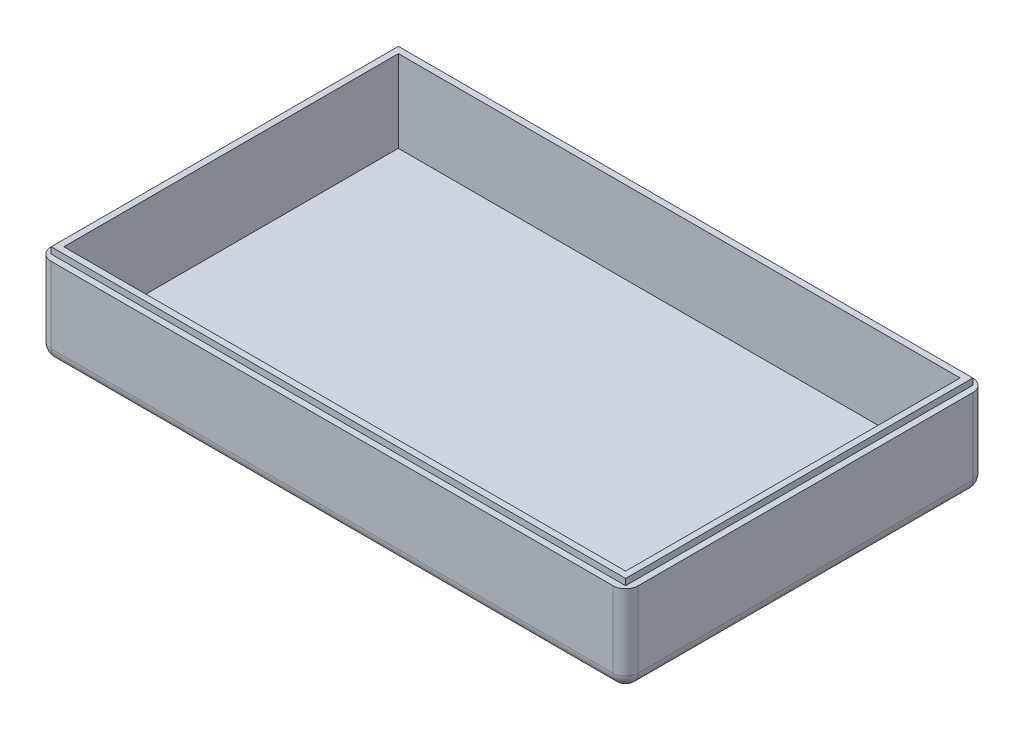
ISO-10303-21;
HEADER;
FILE_DESCRIPTION(('STEP AP214'),'2;1');
FILE_NAME('part.step','',(''),(''),'','','');
FILE_SCHEMA(('AUTOMOTIVE_DESIGN { 1 0 10303 214 1 1 1 1 }'));
ENDSEC;
DATA;
#1=APPLICATION_CONTEXT('core data for automotive mechanical design processes');
#2=APPLICATION_PROTOCOL_DEFINITION('international standard','automotive_design',2000,#1);
#3=PRODUCT_CONTEXT('',#1,'mechanical');
#4=PRODUCT('Part','Part','',(#3));
#5=PRODUCT_RELATED_PRODUCT_CATEGORY('part','',(#4));
#6=PRODUCT_DEFINITION_FORMATION('','',#4);
#7=PRODUCT_DEFINITION_CONTEXT('part definition',#1,'design');
#8=PRODUCT_DEFINITION('design','',#6,#7);
#9=PRODUCT_DEFINITION_SHAPE('','',#8);
#10=(LENGTH_UNIT() NAMED_UNIT(*) SI_UNIT(.MILLI.,.METRE.));
#11=(NAMED_UNIT(*) PLANE_ANGLE_UNIT() SI_UNIT($,.RADIAN.));
#12=(NAMED_UNIT(*) SI_UNIT($,.STERADIAN.) SOLID_ANGLE_UNIT());
#13=UNCERTAINTY_MEASURE_WITH_UNIT(LENGTH_MEASURE(1.E-05),#10,'distance_accuracy_value','');
#14=(GEOMETRIC_REPRESENTATION_CONTEXT(3) GLOBAL_UNCERTAINTY_ASSIGNED_CONTEXT((#13)) GLOBAL_UNIT_ASSIGNED_CONTEXT((#10,
#11,#12)) REPRESENTATION_CONTEXT('',''));
#15=CARTESIAN_POINT('',(0.,0.,0.));
#16=DIRECTION('',(0.,0.,1.));
#17=DIRECTION('',(1.,0.,0.));
#18=AXIS2_PLACEMENT_3D('',#15,#16,#17);
#19=CARTESIAN_POINT('',(0.,14.,0.));
#20=DIRECTION('',(0.,-1.,0.));
#21=DIRECTION('',(0.,0.,-1.));
#22=AXIS2_PLACEMENT_3D('',#19,#20,#21);
#23=PLANE('',#22);
#24=DIRECTION('',(1.,0.,0.));
#25=VECTOR('',#24,1.);
#26=CARTESIAN_POINT('',(-46.5,14.,28.5));
#27=LINE('',#26,#25);
#28=CARTESIAN_POINT('',(-44.5,14.,28.5));
#29=VERTEX_POINT('',#28);
#30=CARTESIAN_POINT('',(44.5,14.,28.5));
#31=VERTEX_POINT('',#30);
#32=EDGE_CURVE('E275',#29,#31,#27,.T.);
#33=ORIENTED_EDGE('',*,*,#32,.T.);
#34=CARTESIAN_POINT('',(44.5,14.,26.5));
#35=DIRECTION('',(0.,-1.,0.));
#36=DIRECTION('',(0.,0.,-1.));
#37=AXIS2_PLACEMENT_3D('',#34,#35,#36);
#38=CIRCLE('',#37,2.);
#39=CARTESIAN_POINT('',(46.5,14.,26.5));
#40=VERTEX_POINT('',#39);
#41=EDGE_CURVE('E307',#31,#40,#38,.F.);
#42=ORIENTED_EDGE('',*,*,#41,.T.);
#43=DIRECTION('',(0.,0.,-1.));
#44=VECTOR('',#43,1.);
#45=CARTESIAN_POINT('',(46.5,14.,28.5));
#46=LINE('',#45,#44);
#47=CARTESIAN_POINT('',(46.5,14.,-26.5));
#48=VERTEX_POINT('',#47);
#49=EDGE_CURVE('E252',#40,#48,#46,.T.);
#50=ORIENTED_EDGE('',*,*,#49,.T.);
#51=CARTESIAN_POINT('',(44.5,14.,-26.5));
#52=DIRECTION('',(0.,-1.,0.));
#53=DIRECTION('',(0.,0.,-1.));
#54=AXIS2_PLACEMENT_3D('',#51,#52,#53);
#55=CIRCLE('',#54,2.);
#56=CARTESIAN_POINT('',(44.4999999999999,14.,-28.5));
#57=VERTEX_POINT('',#56);
#58=EDGE_CURVE('E304',#48,#57,#55,.F.);
#59=ORIENTED_EDGE('',*,*,#58,.T.);
#60=DIRECTION('',(-1.,0.,0.));
#61=VECTOR('',#60,1.);
#62=CARTESIAN_POINT('',(-46.5,14.,-28.5));
#63=LINE('',#62,#61);
#64=CARTESIAN_POINT('',(-44.5,14.,-28.5));
#65=VERTEX_POINT('',#64);
#66=EDGE_CURVE('E267',#57,#65,#63,.T.);
#67=ORIENTED_EDGE('',*,*,#66,.T.);
#68=CARTESIAN_POINT('',(-44.5,14.,-26.5));
#69=DIRECTION('',(0.,-1.,0.));
#70=DIRECTION('',(0.,0.,-1.));
#71=AXIS2_PLACEMENT_3D('',#68,#69,#70);
#72=CIRCLE('',#71,2.);
#73=CARTESIAN_POINT('',(-46.5,14.,-26.5));
#74=VERTEX_POINT('',#73);
#75=EDGE_CURVE('E301',#65,#74,#72,.F.);
#76=ORIENTED_EDGE('',*,*,#75,.T.);
#77=DIRECTION('',(0.,0.,1.));
#78=VECTOR('',#77,1.);
#79=CARTESIAN_POINT('',(-46.5,14.,28.5));
#80=LINE('',#79,#78);
#81=CARTESIAN_POINT('',(-46.5,14.,26.5));
#82=VERTEX_POINT('',#81);
#83=EDGE_CURVE('E271',#74,#82,#80,.T.);
#84=ORIENTED_EDGE('',*,*,#83,.T.);
#85=CARTESIAN_POINT('',(-44.5,14.,26.5));
#86=DIRECTION('',(0.,-1.,0.));
#87=DIRECTION('',(0.,0.,-1.));
#88=AXIS2_PLACEMENT_3D('',#85,#86,#87);
#89=CIRCLE('',#88,2.);
#90=EDGE_CURVE('E298',#82,#29,#89,.F.);
#91=ORIENTED_EDGE('',*,*,#90,.T.);
#92=EDGE_LOOP('',(#33,#42,#50,#59,#67,#76,#84,#91));
#93=FACE_BOUND('',#92,.T.);
#94=DIRECTION('',(-1.,0.,0.));
#95=VECTOR('',#94,1.);
#96=CARTESIAN_POINT('',(-45.5,14.,-27.5));
#97=LINE('',#96,#95);
#98=CARTESIAN_POINT('',(45.5,14.,-27.5));
#99=VERTEX_POINT('',#98);
#100=CARTESIAN_POINT('',(-45.5,14.,-27.5));
#101=VERTEX_POINT('',#100);
#102=EDGE_CURVE('E198',#99,#101,#97,.T.);
#103=ORIENTED_EDGE('',*,*,#102,.F.);
#104=DIRECTION('',(0.,0.,-1.));
#105=VECTOR('',#104,1.);
#106=CARTESIAN_POINT('',(45.5,14.,-27.5));
#107=LINE('',#106,#105);
#108=CARTESIAN_POINT('',(45.5,14.,27.5));
#109=VERTEX_POINT('',#108);
#110=EDGE_CURVE('E204',#109,#99,#107,.T.);
#111=ORIENTED_EDGE('',*,*,#110,.F.);
#112=DIRECTION('',(1.,0.,0.));
#113=VECTOR('',#112,1.);
#114=CARTESIAN_POINT('',(-45.5,14.,27.5));
#115=LINE('',#114,#113);
#116=CARTESIAN_POINT('',(-45.5,14.,27.5));
#117=VERTEX_POINT('',#116);
#118=EDGE_CURVE('E221',#117,#109,#115,.T.);
#119=ORIENTED_EDGE('',*,*,#118,.F.);
#120=DIRECTION('',(0.,0.,1.));
#121=VECTOR('',#120,1.);
#122=CARTESIAN_POINT('',(-45.5,14.,-27.5));
#123=LINE('',#122,#121);
#124=EDGE_CURVE('E217',#101,#117,#123,.T.);
#125=ORIENTED_EDGE('',*,*,#124,.F.);
#126=EDGE_LOOP('',(#103,#111,#119,#125));
#127=FACE_BOUND('',#126,.T.);
#128=ADVANCED_FACE('F38',(#93,#127),#23,.F.);
#129=CARTESIAN_POINT('',(46.5,14.,28.5));
#130=DIRECTION('',(-1.,0.,0.));
#131=DIRECTION('',(0.,0.,1.));
#132=AXIS2_PLACEMENT_3D('',#129,#130,#131);
#133=PLANE('',#132);
#134=ORIENTED_EDGE('',*,*,#49,.F.);
#135=DIRECTION('',(0.,-1.,0.));
#136=VECTOR('',#135,1.);
#137=CARTESIAN_POINT('',(46.5,14.,26.5));
#138=LINE('',#137,#136);
#139=CARTESIAN_POINT('',(46.5,2.,26.5));
#140=VERTEX_POINT('',#139);
#141=EDGE_CURVE('E285',#40,#140,#138,.T.);
#142=ORIENTED_EDGE('',*,*,#141,.T.);
#143=DIRECTION('',(0.,0.,-1.));
#144=VECTOR('',#143,1.);
#145=CARTESIAN_POINT('',(46.5,2.,-28.5));
#146=LINE('',#145,#144);
#147=CARTESIAN_POINT('',(46.5,2.,-26.5));
#148=VERTEX_POINT('',#147);
#149=EDGE_CURVE('E279',#140,#148,#146,.T.);
#150=ORIENTED_EDGE('',*,*,#149,.T.);
#151=DIRECTION('',(0.,-1.,0.));
#152=VECTOR('',#151,1.);
#153=CARTESIAN_POINT('',(46.5,14.,-26.5));
#154=LINE('',#153,#152);
#155=EDGE_CURVE('E282',#148,#48,#154,.F.);
#156=ORIENTED_EDGE('',*,*,#155,.T.);
#157=EDGE_LOOP('',(#134,#142,#150,#156));
#158=FACE_BOUND('',#157,.T.);
#159=ADVANCED_FACE('F441',(#158),#133,.F.);
#160=CARTESIAN_POINT('',(-46.5,14.,-28.5));
#161=DIRECTION('',(0.,0.,1.));
#162=DIRECTION('',(1.,0.,0.));
#163=AXIS2_PLACEMENT_3D('',#160,#161,#162);
#164=PLANE('',#163);
#165=ORIENTED_EDGE('',*,*,#66,.F.);
#166=DIRECTION('',(0.,-1.,0.));
#167=VECTOR('',#166,1.);
#168=CARTESIAN_POINT('',(44.5,14.,-28.5));
#169=LINE('',#168,#167);
#170=CARTESIAN_POINT('',(44.5,2.,-28.5));
#171=VERTEX_POINT('',#170);
#172=EDGE_CURVE('E316',#57,#171,#169,.T.);
#173=ORIENTED_EDGE('',*,*,#172,.T.);
#174=DIRECTION('',(-1.,0.,0.));
#175=VECTOR('',#174,1.);
#176=CARTESIAN_POINT('',(-46.5,2.,-28.5));
#177=LINE('',#176,#175);
#178=CARTESIAN_POINT('',(-44.5,2.,-28.5));
#179=VERTEX_POINT('',#178);
#180=EDGE_CURVE('E313',#171,#179,#177,.T.);
#181=ORIENTED_EDGE('',*,*,#180,.T.);
#182=DIRECTION('',(0.,-1.,0.));
#183=VECTOR('',#182,1.);
#184=CARTESIAN_POINT('',(-44.5,14.,-28.5));
#185=LINE('',#184,#183);
#186=EDGE_CURVE('E310',#179,#65,#185,.F.);
#187=ORIENTED_EDGE('',*,*,#186,.T.);
#188=EDGE_LOOP('',(#165,#173,#181,#187));
#189=FACE_BOUND('',#188,.T.);
#190=ADVANCED_FACE('F391',(#189),#164,.F.);
#191=CARTESIAN_POINT('',(-46.5,14.,28.5));
#192=DIRECTION('',(1.,0.,0.));
#193=DIRECTION('',(0.,0.,-1.));
#194=AXIS2_PLACEMENT_3D('',#191,#192,#193);
#195=PLANE('',#194);
#196=ORIENTED_EDGE('',*,*,#83,.F.);
#197=DIRECTION('',(0.,-1.,0.));
#198=VECTOR('',#197,1.);
#199=CARTESIAN_POINT('',(-46.5,14.,-26.5));
#200=LINE('',#199,#198);
#201=CARTESIAN_POINT('',(-46.5,2.,-26.5));
#202=VERTEX_POINT('',#201);
#203=EDGE_CURVE('E11',#74,#202,#200,.T.);
#204=ORIENTED_EDGE('',*,*,#203,.T.);
#205=DIRECTION('',(0.,0.,1.));
#206=VECTOR('',#205,1.);
#207=CARTESIAN_POINT('',(-46.5,2.,28.5));
#208=LINE('',#207,#206);
#209=CARTESIAN_POINT('',(-46.5,2.,26.5));
#210=VERTEX_POINT('',#209);
#211=EDGE_CURVE('E48',#202,#210,#208,.T.);
#212=ORIENTED_EDGE('',*,*,#211,.T.);
#213=DIRECTION('',(0.,-1.,0.));
#214=VECTOR('',#213,1.);
#215=CARTESIAN_POINT('',(-46.5,14.,26.5));
#216=LINE('',#215,#214);
#217=EDGE_CURVE('E332',#210,#82,#216,.F.);
#218=ORIENTED_EDGE('',*,*,#217,.T.);
#219=EDGE_LOOP('',(#196,#204,#212,#218));
#220=FACE_BOUND('',#219,.T.);
#221=ADVANCED_FACE('F427',(#220),#195,.F.);
#222=CARTESIAN_POINT('',(-46.5,14.,28.5));
#223=DIRECTION('',(0.,0.,-1.));
#224=DIRECTION('',(-1.,0.,0.));
#225=AXIS2_PLACEMENT_3D('',#222,#223,#224);
#226=PLANE('',#225);
#227=DIRECTION('',(1.,0.,0.));
#228=VECTOR('',#227,1.);
#229=CARTESIAN_POINT('',(46.5,2.,28.5));
#230=LINE('',#229,#228);
#231=CARTESIAN_POINT('',(-44.5,2.,28.5));
#232=VERTEX_POINT('',#231);
#233=CARTESIAN_POINT('',(44.5,2.,28.5));
#234=VERTEX_POINT('',#233);
#235=EDGE_CURVE('E292',#232,#234,#230,.T.);
#236=ORIENTED_EDGE('',*,*,#235,.T.);
#237=DIRECTION('',(0.,-1.,0.));
#238=VECTOR('',#237,1.);
#239=CARTESIAN_POINT('',(44.5,14.,28.5));
#240=LINE('',#239,#238);
#241=EDGE_CURVE('E295',#234,#31,#240,.F.);
#242=ORIENTED_EDGE('',*,*,#241,.T.);
#243=ORIENTED_EDGE('',*,*,#32,.F.);
#244=DIRECTION('',(0.,-1.,0.));
#245=VECTOR('',#244,1.);
#246=CARTESIAN_POINT('',(-44.5,14.,28.5));
#247=LINE('',#246,#245);
#248=EDGE_CURVE('E289',#29,#232,#247,.T.);
#249=ORIENTED_EDGE('',*,*,#248,.T.);
#250=EDGE_LOOP('',(#236,#242,#243,#249));
#251=FACE_BOUND('',#250,.T.);
#252=ADVANCED_FACE('F431',(#251),#226,.F.);
#253=CARTESIAN_POINT('',(0.,0.,0.));
#254=DIRECTION('',(0.,-1.,0.));
#255=DIRECTION('',(0.,0.,-1.));
#256=AXIS2_PLACEMENT_3D('',#253,#254,#255);
#257=PLANE('',#256);
#258=DIRECTION('',(-1.,0.,0.));
#259=VECTOR('',#258,1.);
#260=CARTESIAN_POINT('',(46.5,0.,-26.5));
#261=LINE('',#260,#259);
#262=CARTESIAN_POINT('',(-44.5,0.,-26.5));
#263=VERTEX_POINT('',#262);
#264=CARTESIAN_POINT('',(44.5,0.,-26.5));
#265=VERTEX_POINT('',#264);
#266=EDGE_CURVE('E322',#263,#265,#261,.F.);
#267=ORIENTED_EDGE('',*,*,#266,.T.);
#268=DIRECTION('',(0.,0.,-1.));
#269=VECTOR('',#268,1.);
#270=CARTESIAN_POINT('',(44.5,0.,28.5));
#271=LINE('',#270,#269);
#272=CARTESIAN_POINT('',(44.5,0.,26.5));
#273=VERTEX_POINT('',#272);
#274=EDGE_CURVE('E328',#265,#273,#271,.F.);
#275=ORIENTED_EDGE('',*,*,#274,.T.);
#276=DIRECTION('',(1.,0.,0.));
#277=VECTOR('',#276,1.);
#278=CARTESIAN_POINT('',(-46.5,0.,26.5));
#279=LINE('',#278,#277);
#280=CARTESIAN_POINT('',(-44.5,0.,26.5));
#281=VERTEX_POINT('',#280);
#282=EDGE_CURVE('E325',#273,#281,#279,.F.);
#283=ORIENTED_EDGE('',*,*,#282,.T.);
#284=DIRECTION('',(0.,0.,1.));
#285=VECTOR('',#284,1.);
#286=CARTESIAN_POINT('',(-44.5,0.,-28.5));
#287=LINE('',#286,#285);
#288=EDGE_CURVE('E319',#281,#263,#287,.F.);
#289=ORIENTED_EDGE('',*,*,#288,.T.);
#290=EDGE_LOOP('',(#267,#275,#283,#289));
#291=FACE_BOUND('',#290,.T.);
#292=ADVANCED_FACE('F413',(#291),#257,.T.);
#293=CARTESIAN_POINT('',(0.,15.,0.));
#294=DIRECTION('',(0.,-1.,0.));
#295=DIRECTION('',(0.,0.,-1.));
#296=AXIS2_PLACEMENT_3D('',#293,#294,#295);
#297=PLANE('',#296);
#298=DIRECTION('',(-1.,0.,0.));
#299=VECTOR('',#298,1.);
#300=CARTESIAN_POINT('',(-45.5,15.,-27.5));
#301=LINE('',#300,#299);
#302=CARTESIAN_POINT('',(45.5,15.,-27.5));
#303=VERTEX_POINT('',#302);
#304=CARTESIAN_POINT('',(-45.5,15.,-27.5));
#305=VERTEX_POINT('',#304);
#306=EDGE_CURVE('E199',#303,#305,#301,.T.);
#307=ORIENTED_EDGE('',*,*,#306,.T.);
#308=DIRECTION('',(0.,0.,1.));
#309=VECTOR('',#308,1.);
#310=CARTESIAN_POINT('',(-45.5,15.,-27.5));
#311=LINE('',#310,#309);
#312=CARTESIAN_POINT('',(-45.5,15.,27.5));
#313=VERTEX_POINT('',#312);
#314=EDGE_CURVE('E203',#305,#313,#311,.T.);
#315=ORIENTED_EDGE('',*,*,#314,.T.);
#316=DIRECTION('',(1.,0.,0.));
#317=VECTOR('',#316,1.);
#318=CARTESIAN_POINT('',(-45.5,15.,27.5));
#319=LINE('',#318,#317);
#320=CARTESIAN_POINT('',(45.5,15.,27.5));
#321=VERTEX_POINT('',#320);
#322=EDGE_CURVE('E207',#313,#321,#319,.T.);
#323=ORIENTED_EDGE('',*,*,#322,.T.);
#324=DIRECTION('',(0.,0.,-1.));
#325=VECTOR('',#324,1.);
#326=CARTESIAN_POINT('',(45.5,15.,-27.5));
#327=LINE('',#326,#325);
#328=EDGE_CURVE('E210',#321,#303,#327,.T.);
#329=ORIENTED_EDGE('',*,*,#328,.T.);
#330=EDGE_LOOP('',(#307,#315,#323,#329));
#331=FACE_BOUND('',#330,.T.);
#332=DIRECTION('',(0.,0.,1.));
#333=VECTOR('',#332,1.);
#334=CARTESIAN_POINT('',(-44.5,15.,-26.5));
#335=LINE('',#334,#333);
#336=CARTESIAN_POINT('',(-44.5,15.,-26.5));
#337=VERTEX_POINT('',#336);
#338=CARTESIAN_POINT('',(-44.5,15.,26.5));
#339=VERTEX_POINT('',#338);
#340=EDGE_CURVE('E179',#337,#339,#335,.T.);
#341=ORIENTED_EDGE('',*,*,#340,.F.);
#342=DIRECTION('',(-1.,0.,0.));
#343=VECTOR('',#342,1.);
#344=CARTESIAN_POINT('',(-44.5,15.,-26.5));
#345=LINE('',#344,#343);
#346=CARTESIAN_POINT('',(44.5,15.,-26.5));
#347=VERTEX_POINT('',#346);
#348=EDGE_CURVE('E193',#347,#337,#345,.T.);
#349=ORIENTED_EDGE('',*,*,#348,.F.);
#350=DIRECTION('',(0.,0.,-1.));
#351=VECTOR('',#350,1.);
#352=CARTESIAN_POINT('',(44.5,15.,-26.5));
#353=LINE('',#352,#351);
#354=CARTESIAN_POINT('',(44.5,15.,26.5));
#355=VERTEX_POINT('',#354);
#356=EDGE_CURVE('E189',#355,#347,#353,.T.);
#357=ORIENTED_EDGE('',*,*,#356,.F.);
#358=DIRECTION('',(1.,0.,0.));
#359=VECTOR('',#358,1.);
#360=CARTESIAN_POINT('',(-44.5,15.,26.5));
#361=LINE('',#360,#359);
#362=EDGE_CURVE('E169',#339,#355,#361,.T.);
#363=ORIENTED_EDGE('',*,*,#362,.F.);
#364=EDGE_LOOP('',(#341,#349,#357,#363));
#365=FACE_BOUND('',#364,.T.);
#366=ADVANCED_FACE('F187',(#331,#365),#297,.F.);
#367=CARTESIAN_POINT('',(-45.5,15.,-27.5));
#368=DIRECTION('',(0.,0.,1.));
#369=DIRECTION('',(1.,0.,0.));
#370=AXIS2_PLACEMENT_3D('',#367,#368,#369);
#371=PLANE('',#370);
#372=ORIENTED_EDGE('',*,*,#102,.T.);
#373=DIRECTION('',(0.,-1.,0.));
#374=VECTOR('',#373,1.);
#375=CARTESIAN_POINT('',(-45.5,15.,-27.5));
#376=LINE('',#375,#374);
#377=EDGE_CURVE('E239',#305,#101,#376,.T.);
#378=ORIENTED_EDGE('',*,*,#377,.F.);
#379=ORIENTED_EDGE('',*,*,#306,.F.);
#380=DIRECTION('',(0.,-1.,0.));
#381=VECTOR('',#380,1.);
#382=CARTESIAN_POINT('',(45.5,15.,-27.5));
#383=LINE('',#382,#381);
#384=EDGE_CURVE('E213',#303,#99,#383,.T.);
#385=ORIENTED_EDGE('',*,*,#384,.T.);
#386=EDGE_LOOP('',(#372,#378,#379,#385));
#387=FACE_BOUND('',#386,.T.);
#388=ADVANCED_FACE('F490',(#387),#371,.F.);
#389=CARTESIAN_POINT('',(-45.5,15.,-27.5));
#390=DIRECTION('',(1.,0.,0.));
#391=DIRECTION('',(0.,0.,-1.));
#392=AXIS2_PLACEMENT_3D('',#389,#390,#391);
#393=PLANE('',#392);
#394=ORIENTED_EDGE('',*,*,#124,.T.);
#395=DIRECTION('',(0.,-1.,0.));
#396=VECTOR('',#395,1.);
#397=CARTESIAN_POINT('',(-45.5,15.,27.5));
#398=LINE('',#397,#396);
#399=EDGE_CURVE('E235',#313,#117,#398,.T.);
#400=ORIENTED_EDGE('',*,*,#399,.F.);
#401=ORIENTED_EDGE('',*,*,#314,.F.);
#402=ORIENTED_EDGE('',*,*,#377,.T.);
#403=EDGE_LOOP('',(#394,#400,#401,#402));
#404=FACE_BOUND('',#403,.T.);
#405=ADVANCED_FACE('F637',(#404),#393,.F.);
#406=CARTESIAN_POINT('',(-45.5,15.,27.5));
#407=DIRECTION('',(0.,0.,-1.));
#408=DIRECTION('',(-1.,0.,0.));
#409=AXIS2_PLACEMENT_3D('',#406,#407,#408);
#410=PLANE('',#409);
#411=ORIENTED_EDGE('',*,*,#118,.T.);
#412=DIRECTION('',(0.,-1.,0.));
#413=VECTOR('',#412,1.);
#414=CARTESIAN_POINT('',(45.5,15.,27.5));
#415=LINE('',#414,#413);
#416=EDGE_CURVE('E231',#321,#109,#415,.T.);
#417=ORIENTED_EDGE('',*,*,#416,.F.);
#418=ORIENTED_EDGE('',*,*,#322,.F.);
#419=ORIENTED_EDGE('',*,*,#399,.T.);
#420=EDGE_LOOP('',(#411,#417,#418,#419));
#421=FACE_BOUND('',#420,.T.);
#422=ADVANCED_FACE('F628',(#421),#410,.F.);
#423=CARTESIAN_POINT('',(45.5,15.,-27.5));
#424=DIRECTION('',(-1.,0.,0.));
#425=DIRECTION('',(0.,0.,1.));
#426=AXIS2_PLACEMENT_3D('',#423,#424,#425);
#427=PLANE('',#426);
#428=ORIENTED_EDGE('',*,*,#110,.T.);
#429=ORIENTED_EDGE('',*,*,#384,.F.);
#430=ORIENTED_EDGE('',*,*,#328,.F.);
#431=ORIENTED_EDGE('',*,*,#416,.T.);
#432=EDGE_LOOP('',(#428,#429,#430,#431));
#433=FACE_BOUND('',#432,.T.);
#434=ADVANCED_FACE('F500',(#433),#427,.F.);
#435=CARTESIAN_POINT('',(0.,2.,0.));
#436=DIRECTION('',(0.,-1.,0.));
#437=DIRECTION('',(0.,0.,-1.));
#438=AXIS2_PLACEMENT_3D('',#435,#436,#437);
#439=PLANE('',#438);
#440=DIRECTION('',(0.,0.,-1.));
#441=VECTOR('',#440,1.);
#442=CARTESIAN_POINT('',(44.5,2.,0.));
#443=LINE('',#442,#441);
#444=CARTESIAN_POINT('',(44.5,2.,26.5));
#445=VERTEX_POINT('',#444);
#446=CARTESIAN_POINT('',(44.5,2.,-26.5));
#447=VERTEX_POINT('',#446);
#448=EDGE_CURVE('E243',#445,#447,#443,.T.);
#449=ORIENTED_EDGE('',*,*,#448,.T.);
#450=DIRECTION('',(-1.,0.,0.));
#451=VECTOR('',#450,1.);
#452=CARTESIAN_POINT('',(0.,2.,-26.5));
#453=LINE('',#452,#451);
#454=CARTESIAN_POINT('',(-44.5,2.,-26.5));
#455=VERTEX_POINT('',#454);
#456=EDGE_CURVE('E247',#447,#455,#453,.T.);
#457=ORIENTED_EDGE('',*,*,#456,.T.);
#458=DIRECTION('',(0.,0.,1.));
#459=VECTOR('',#458,1.);
#460=CARTESIAN_POINT('',(-44.5,2.,0.));
#461=LINE('',#460,#459);
#462=CARTESIAN_POINT('',(-44.5,2.,26.5));
#463=VERTEX_POINT('',#462);
#464=EDGE_CURVE('E257',#455,#463,#461,.T.);
#465=ORIENTED_EDGE('',*,*,#464,.T.);
#466=DIRECTION('',(1.,0.,0.));
#467=VECTOR('',#466,1.);
#468=CARTESIAN_POINT('',(0.,2.,26.5));
#469=LINE('',#468,#467);
#470=EDGE_CURVE('E171',#463,#445,#469,.T.);
#471=ORIENTED_EDGE('',*,*,#470,.T.);
#472=EDGE_LOOP('',(#449,#457,#465,#471));
#473=FACE_BOUND('',#472,.T.);
#474=ADVANCED_FACE('F495',(#473),#439,.F.);
#475=CARTESIAN_POINT('',(-46.5,14.,-26.5));
#476=DIRECTION('',(0.,0.,1.));
#477=DIRECTION('',(1.,0.,0.));
#478=AXIS2_PLACEMENT_3D('',#475,#476,#477);
#479=PLANE('',#478);
#480=ORIENTED_EDGE('',*,*,#456,.F.);
#481=DIRECTION('',(0.,-1.,0.));
#482=VECTOR('',#481,1.);
#483=CARTESIAN_POINT('',(44.5,14.,-26.5));
#484=LINE('',#483,#482);
#485=EDGE_CURVE('E248',#347,#447,#484,.T.);
#486=ORIENTED_EDGE('',*,*,#485,.F.);
#487=ORIENTED_EDGE('',*,*,#348,.T.);
#488=DIRECTION('',(0.,-1.,0.));
#489=VECTOR('',#488,1.);
#490=CARTESIAN_POINT('',(-44.5,14.,-26.5));
#491=LINE('',#490,#489);
#492=EDGE_CURVE('E175',#337,#455,#491,.T.);
#493=ORIENTED_EDGE('',*,*,#492,.T.);
#494=EDGE_LOOP('',(#480,#486,#487,#493));
#495=FACE_BOUND('',#494,.T.);
#496=ADVANCED_FACE('F492',(#495),#479,.T.);
#497=CARTESIAN_POINT('',(-44.5,14.,28.5));
#498=DIRECTION('',(1.,0.,0.));
#499=DIRECTION('',(0.,0.,-1.));
#500=AXIS2_PLACEMENT_3D('',#497,#498,#499);
#501=PLANE('',#500);
#502=ORIENTED_EDGE('',*,*,#464,.F.);
#503=ORIENTED_EDGE('',*,*,#492,.F.);
#504=ORIENTED_EDGE('',*,*,#340,.T.);
#505=DIRECTION('',(0.,-1.,0.));
#506=VECTOR('',#505,1.);
#507=CARTESIAN_POINT('',(-44.5,14.,26.5));
#508=LINE('',#507,#506);
#509=EDGE_CURVE('E164',#339,#463,#508,.T.);
#510=ORIENTED_EDGE('',*,*,#509,.T.);
#511=EDGE_LOOP('',(#502,#503,#504,#510));
#512=FACE_BOUND('',#511,.T.);
#513=ADVANCED_FACE('F180',(#512),#501,.T.);
#514=CARTESIAN_POINT('',(-46.5,14.,26.5));
#515=DIRECTION('',(0.,0.,-1.));
#516=DIRECTION('',(-1.,0.,0.));
#517=AXIS2_PLACEMENT_3D('',#514,#515,#516);
#518=PLANE('',#517);
#519=ORIENTED_EDGE('',*,*,#470,.F.);
#520=ORIENTED_EDGE('',*,*,#509,.F.);
#521=ORIENTED_EDGE('',*,*,#362,.T.);
#522=DIRECTION('',(0.,-1.,0.));
#523=VECTOR('',#522,1.);
#524=CARTESIAN_POINT('',(44.5,14.,26.5));
#525=LINE('',#524,#523);
#526=EDGE_CURVE('E176',#355,#445,#525,.T.);
#527=ORIENTED_EDGE('',*,*,#526,.T.);
#528=EDGE_LOOP('',(#519,#520,#521,#527));
#529=FACE_BOUND('',#528,.T.);
#530=ADVANCED_FACE('F166',(#529),#518,.T.);
#531=CARTESIAN_POINT('',(44.5,14.,28.5));
#532=DIRECTION('',(-1.,0.,0.));
#533=DIRECTION('',(0.,0.,1.));
#534=AXIS2_PLACEMENT_3D('',#531,#532,#533);
#535=PLANE('',#534);
#536=ORIENTED_EDGE('',*,*,#448,.F.);
#537=ORIENTED_EDGE('',*,*,#526,.F.);
#538=ORIENTED_EDGE('',*,*,#356,.T.);
#539=ORIENTED_EDGE('',*,*,#485,.T.);
#540=EDGE_LOOP('',(#536,#537,#538,#539));
#541=FACE_BOUND('',#540,.T.);
#542=ADVANCED_FACE('F477',(#541),#535,.T.);
#543=CARTESIAN_POINT('',(-44.5,14.,-26.5));
#544=DIRECTION('',(0.,-1.,0.));
#545=DIRECTION('',(0.,0.,-1.));
#546=AXIS2_PLACEMENT_3D('',#543,#544,#545);
#547=CYLINDRICAL_SURFACE('',#546,2.);
#548=CARTESIAN_POINT('',(-44.5,2.,-26.5));
#549=DIRECTION('',(0.,-1.,0.));
#550=DIRECTION('',(0.,0.,-1.));
#551=AXIS2_PLACEMENT_3D('',#548,#549,#550);
#552=CIRCLE('',#551,2.);
#553=EDGE_CURVE('E42',#202,#179,#552,.T.);
#554=ORIENTED_EDGE('',*,*,#553,.F.);
#555=ORIENTED_EDGE('',*,*,#203,.F.);
#556=ORIENTED_EDGE('',*,*,#75,.F.);
#557=ORIENTED_EDGE('',*,*,#186,.F.);
#558=EDGE_LOOP('',(#554,#555,#556,#557));
#559=FACE_BOUND('',#558,.T.);
#560=ADVANCED_FACE('F40',(#559),#547,.T.);
#561=CARTESIAN_POINT('',(-44.5,2.,-26.5));
#562=DIRECTION('',(0.,0.,-1.));
#563=DIRECTION('',(-1.,0.,0.));
#564=AXIS2_PLACEMENT_3D('',#561,#562,#563);
#565=SPHERICAL_SURFACE('',#564,2.);
#566=CARTESIAN_POINT('',(-44.5,2.,-26.5));
#567=DIRECTION('',(0.,0.,-1.));
#568=DIRECTION('',(-1.,0.,0.));
#569=AXIS2_PLACEMENT_3D('',#566,#567,#568);
#570=CIRCLE('',#569,2.);
#571=EDGE_CURVE('E371',#202,#263,#570,.F.);
#572=ORIENTED_EDGE('',*,*,#571,.F.);
#573=ORIENTED_EDGE('',*,*,#553,.T.);
#574=CARTESIAN_POINT('',(-44.5,2.,-26.5));
#575=DIRECTION('',(-1.,0.,0.));
#576=DIRECTION('',(0.,0.,1.));
#577=AXIS2_PLACEMENT_3D('',#574,#575,#576);
#578=CIRCLE('',#577,2.);
#579=EDGE_CURVE('E374',#263,#179,#578,.F.);
#580=ORIENTED_EDGE('',*,*,#579,.F.);
#581=EDGE_LOOP('',(#572,#573,#580));
#582=FACE_BOUND('',#581,.T.);
#583=ADVANCED_FACE('F385',(#582),#565,.T.);
#584=CARTESIAN_POINT('',(44.5,14.,-26.5));
#585=DIRECTION('',(0.,-1.,0.));
#586=DIRECTION('',(0.,0.,-1.));
#587=AXIS2_PLACEMENT_3D('',#584,#585,#586);
#588=CYLINDRICAL_SURFACE('',#587,2.);
#589=ORIENTED_EDGE('',*,*,#58,.F.);
#590=ORIENTED_EDGE('',*,*,#155,.F.);
#591=CARTESIAN_POINT('',(44.5,2.,-26.5));
#592=DIRECTION('',(0.,-1.,0.));
#593=DIRECTION('',(0.,0.,-1.));
#594=AXIS2_PLACEMENT_3D('',#591,#592,#593);
#595=CIRCLE('',#594,2.);
#596=EDGE_CURVE('E367',#171,#148,#595,.T.);
#597=ORIENTED_EDGE('',*,*,#596,.F.);
#598=ORIENTED_EDGE('',*,*,#172,.F.);
#599=EDGE_LOOP('',(#589,#590,#597,#598));
#600=FACE_BOUND('',#599,.T.);
#601=ADVANCED_FACE('F399',(#600),#588,.T.);
#602=CARTESIAN_POINT('',(-46.5,2.,-26.5));
#603=DIRECTION('',(1.,0.,0.));
#604=DIRECTION('',(0.,0.,-1.));
#605=AXIS2_PLACEMENT_3D('',#602,#603,#604);
#606=CYLINDRICAL_SURFACE('',#605,2.);
#607=ORIENTED_EDGE('',*,*,#579,.T.);
#608=ORIENTED_EDGE('',*,*,#180,.F.);
#609=CARTESIAN_POINT('',(44.5,2.,-26.5));
#610=DIRECTION('',(1.,0.,0.));
#611=DIRECTION('',(0.,0.,-1.));
#612=AXIS2_PLACEMENT_3D('',#609,#610,#611);
#613=CIRCLE('',#612,2.);
#614=EDGE_CURVE('E363',#265,#171,#613,.T.);
#615=ORIENTED_EDGE('',*,*,#614,.F.);
#616=ORIENTED_EDGE('',*,*,#266,.F.);
#617=EDGE_LOOP('',(#607,#608,#615,#616));
#618=FACE_BOUND('',#617,.T.);
#619=ADVANCED_FACE('F402',(#618),#606,.T.);
#620=CARTESIAN_POINT('',(-44.5,2.,28.5));
#621=DIRECTION('',(0.,0.,-1.));
#622=DIRECTION('',(-1.,0.,0.));
#623=AXIS2_PLACEMENT_3D('',#620,#621,#622);
#624=CYLINDRICAL_SURFACE('',#623,2.);
#625=ORIENTED_EDGE('',*,*,#571,.T.);
#626=ORIENTED_EDGE('',*,*,#288,.F.);
#627=CARTESIAN_POINT('',(-44.5,2.,26.5));
#628=DIRECTION('',(0.,0.,1.));
#629=DIRECTION('',(1.,0.,0.));
#630=AXIS2_PLACEMENT_3D('',#627,#628,#629);
#631=CIRCLE('',#630,2.);
#632=EDGE_CURVE('E359',#210,#281,#631,.T.);
#633=ORIENTED_EDGE('',*,*,#632,.F.);
#634=ORIENTED_EDGE('',*,*,#211,.F.);
#635=EDGE_LOOP('',(#625,#626,#633,#634));
#636=FACE_BOUND('',#635,.T.);
#637=ADVANCED_FACE('F417',(#636),#624,.T.);
#638=CARTESIAN_POINT('',(-44.5,14.,26.5));
#639=DIRECTION('',(0.,-1.,0.));
#640=DIRECTION('',(0.,0.,-1.));
#641=AXIS2_PLACEMENT_3D('',#638,#639,#640);
#642=CYLINDRICAL_SURFACE('',#641,2.);
#643=ORIENTED_EDGE('',*,*,#90,.F.);
#644=ORIENTED_EDGE('',*,*,#217,.F.);
#645=CARTESIAN_POINT('',(-44.5,2.,26.5));
#646=DIRECTION('',(0.,-1.,0.));
#647=DIRECTION('',(0.,0.,-1.));
#648=AXIS2_PLACEMENT_3D('',#645,#646,#647);
#649=CIRCLE('',#648,2.);
#650=EDGE_CURVE('E355',#232,#210,#649,.T.);
#651=ORIENTED_EDGE('',*,*,#650,.F.);
#652=ORIENTED_EDGE('',*,*,#248,.F.);
#653=EDGE_LOOP('',(#643,#644,#651,#652));
#654=FACE_BOUND('',#653,.T.);
#655=ADVANCED_FACE('F426',(#654),#642,.T.);
#656=CARTESIAN_POINT('',(44.5,2.,-26.5));
#657=DIRECTION('',(0.,0.,-1.));
#658=DIRECTION('',(-1.,0.,0.));
#659=AXIS2_PLACEMENT_3D('',#656,#657,#658);
#660=SPHERICAL_SURFACE('',#659,2.);
#661=ORIENTED_EDGE('',*,*,#614,.T.);
#662=ORIENTED_EDGE('',*,*,#596,.T.);
#663=CARTESIAN_POINT('',(44.5,2.,-26.5));
#664=DIRECTION('',(0.,0.,-1.));
#665=DIRECTION('',(-1.,0.,0.));
#666=AXIS2_PLACEMENT_3D('',#663,#664,#665);
#667=CIRCLE('',#666,2.);
#668=EDGE_CURVE('E351',#265,#148,#667,.F.);
#669=ORIENTED_EDGE('',*,*,#668,.F.);
#670=EDGE_LOOP('',(#661,#662,#669));
#671=FACE_BOUND('',#670,.T.);
#672=ADVANCED_FACE('F406',(#671),#660,.T.);
#673=CARTESIAN_POINT('',(-44.5,2.,26.5));
#674=DIRECTION('',(-1.,0.,0.));
#675=DIRECTION('',(0.,0.,1.));
#676=AXIS2_PLACEMENT_3D('',#673,#674,#675);
#677=SPHERICAL_SURFACE('',#676,2.);
#678=ORIENTED_EDGE('',*,*,#650,.T.);
#679=ORIENTED_EDGE('',*,*,#632,.T.);
#680=CARTESIAN_POINT('',(-44.5,2.,26.5));
#681=DIRECTION('',(-1.,0.,0.));
#682=DIRECTION('',(0.,0.,1.));
#683=AXIS2_PLACEMENT_3D('',#680,#681,#682);
#684=CIRCLE('',#683,2.);
#685=EDGE_CURVE('E347',#232,#281,#684,.F.);
#686=ORIENTED_EDGE('',*,*,#685,.F.);
#687=EDGE_LOOP('',(#678,#679,#686));
#688=FACE_BOUND('',#687,.T.);
#689=ADVANCED_FACE('F421',(#688),#677,.T.);
#690=CARTESIAN_POINT('',(44.5,2.,28.5));
#691=DIRECTION('',(0.,0.,1.));
#692=DIRECTION('',(1.,0.,0.));
#693=AXIS2_PLACEMENT_3D('',#690,#691,#692);
#694=CYLINDRICAL_SURFACE('',#693,2.);
#695=ORIENTED_EDGE('',*,*,#668,.T.);
#696=ORIENTED_EDGE('',*,*,#149,.F.);
#697=CARTESIAN_POINT('',(44.5,2.,26.5));
#698=DIRECTION('',(0.,0.,1.));
#699=DIRECTION('',(1.,0.,0.));
#700=AXIS2_PLACEMENT_3D('',#697,#698,#699);
#701=CIRCLE('',#700,2.);
#702=EDGE_CURVE('E343',#273,#140,#701,.T.);
#703=ORIENTED_EDGE('',*,*,#702,.F.);
#704=ORIENTED_EDGE('',*,*,#274,.F.);
#705=EDGE_LOOP('',(#695,#696,#703,#704));
#706=FACE_BOUND('',#705,.T.);
#707=ADVANCED_FACE('F410',(#706),#694,.T.);
#708=CARTESIAN_POINT('',(-46.5,2.,26.5));
#709=DIRECTION('',(-1.,0.,0.));
#710=DIRECTION('',(0.,0.,1.));
#711=AXIS2_PLACEMENT_3D('',#708,#709,#710);
#712=CYLINDRICAL_SURFACE('',#711,2.);
#713=ORIENTED_EDGE('',*,*,#685,.T.);
#714=ORIENTED_EDGE('',*,*,#282,.F.);
#715=CARTESIAN_POINT('',(44.5,2.,26.5));
#716=DIRECTION('',(1.,0.,0.));
#717=DIRECTION('',(0.,0.,-1.));
#718=AXIS2_PLACEMENT_3D('',#715,#716,#717);
#719=CIRCLE('',#718,2.);
#720=EDGE_CURVE('E340',#234,#273,#719,.T.);
#721=ORIENTED_EDGE('',*,*,#720,.F.);
#722=ORIENTED_EDGE('',*,*,#235,.F.);
#723=EDGE_LOOP('',(#713,#714,#721,#722));
#724=FACE_BOUND('',#723,.T.);
#725=ADVANCED_FACE('F456',(#724),#712,.T.);
#726=CARTESIAN_POINT('',(44.5,2.,26.5));
#727=DIRECTION('',(0.,-1.,0.));
#728=DIRECTION('',(0.,0.,-1.));
#729=AXIS2_PLACEMENT_3D('',#726,#727,#728);
#730=SPHERICAL_SURFACE('',#729,2.);
#731=ORIENTED_EDGE('',*,*,#720,.T.);
#732=ORIENTED_EDGE('',*,*,#702,.T.);
#733=CARTESIAN_POINT('',(44.5,2.,26.5));
#734=DIRECTION('',(0.,-1.,0.));
#735=DIRECTION('',(0.,0.,-1.));
#736=AXIS2_PLACEMENT_3D('',#733,#734,#735);
#737=CIRCLE('',#736,2.);
#738=EDGE_CURVE('E337',#234,#140,#737,.F.);
#739=ORIENTED_EDGE('',*,*,#738,.F.);
#740=EDGE_LOOP('',(#731,#732,#739));
#741=FACE_BOUND('',#740,.T.);
#742=ADVANCED_FACE('F439',(#741),#730,.T.);
#743=CARTESIAN_POINT('',(44.5,14.,26.5));
#744=DIRECTION('',(0.,-1.,0.));
#745=DIRECTION('',(0.,0.,-1.));
#746=AXIS2_PLACEMENT_3D('',#743,#744,#745);
#747=CYLINDRICAL_SURFACE('',#746,2.);
#748=ORIENTED_EDGE('',*,*,#41,.F.);
#749=ORIENTED_EDGE('',*,*,#241,.F.);
#750=ORIENTED_EDGE('',*,*,#738,.T.);
#751=ORIENTED_EDGE('',*,*,#141,.F.);
#752=EDGE_LOOP('',(#748,#749,#750,#751));
#753=FACE_BOUND('',#752,.T.);
#754=ADVANCED_FACE('F436',(#753),#747,.T.);
#755=CLOSED_SHELL('',(#128,#159,#190,#221,#252,#292,#366,#388,#405,#422,#434,#474,#496,#513,
#530,#542,#560,#583,#601,#619,#637,#655,#672,#689,#707,#725,#742,#754));
#756=MANIFOLD_SOLID_BREP('B2',#755);
#757=ADVANCED_BREP_SHAPE_REPRESENTATION('',(#18,#756),#14);
#758=SHAPE_DEFINITION_REPRESENTATION(#9,#757);
ENDSEC;
END-ISO-10303-21;
